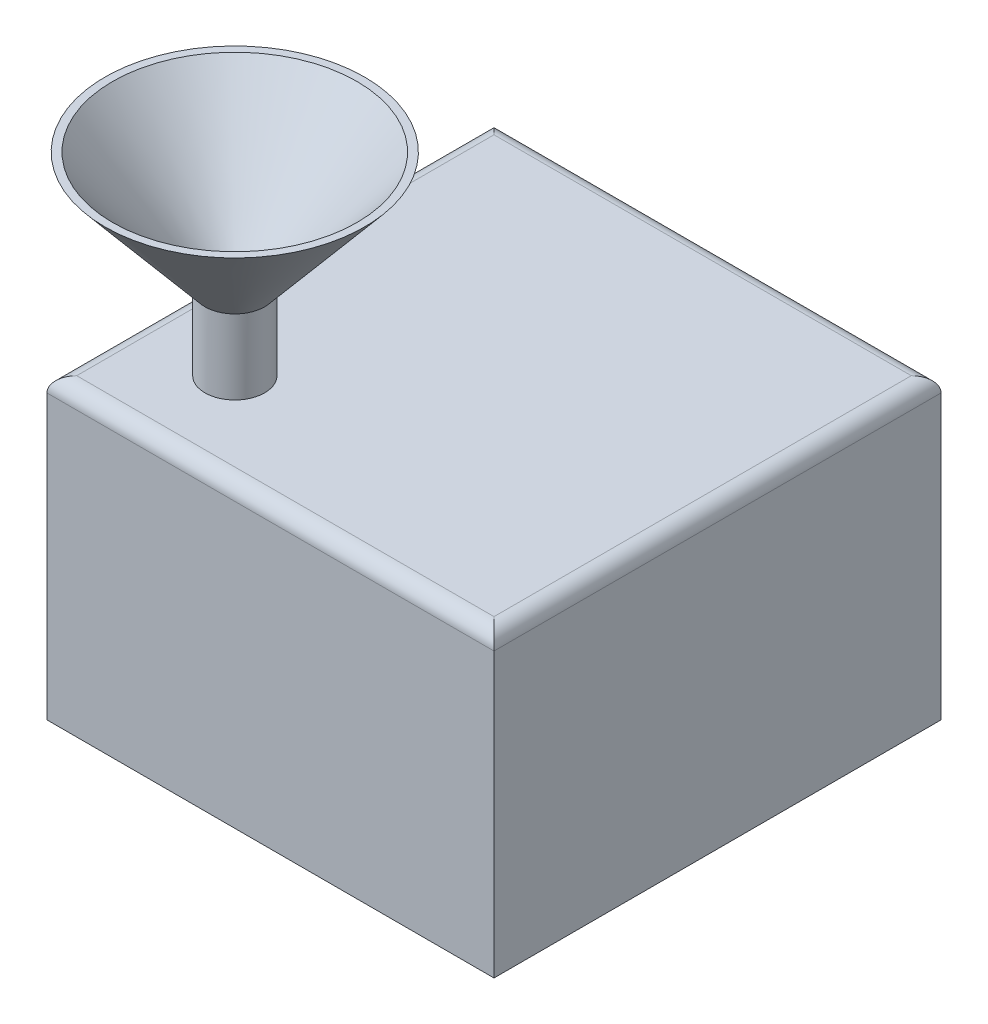
ISO-10303-21;
HEADER;
FILE_DESCRIPTION(('STEP AP214'),'2;1');
FILE_NAME('part.step','',(''),(''),'','','');
FILE_SCHEMA(('AUTOMOTIVE_DESIGN { 1 0 10303 214 1 1 1 1 }'));
ENDSEC;
DATA;
#1=APPLICATION_CONTEXT('core data for automotive mechanical design processes');
#2=APPLICATION_PROTOCOL_DEFINITION('international standard','automotive_design',2000,#1);
#3=PRODUCT_CONTEXT('',#1,'mechanical');
#4=PRODUCT('Part','Part','',(#3));
#5=PRODUCT_RELATED_PRODUCT_CATEGORY('part','',(#4));
#6=PRODUCT_DEFINITION_FORMATION('','',#4);
#7=PRODUCT_DEFINITION_CONTEXT('part definition',#1,'design');
#8=PRODUCT_DEFINITION('design','',#6,#7);
#9=PRODUCT_DEFINITION_SHAPE('','',#8);
#10=(LENGTH_UNIT() NAMED_UNIT(*) SI_UNIT(.MILLI.,.METRE.));
#11=(NAMED_UNIT(*) PLANE_ANGLE_UNIT() SI_UNIT($,.RADIAN.));
#12=(NAMED_UNIT(*) SI_UNIT($,.STERADIAN.) SOLID_ANGLE_UNIT());
#13=UNCERTAINTY_MEASURE_WITH_UNIT(LENGTH_MEASURE(1.E-05),#10,'distance_accuracy_value','');
#14=(GEOMETRIC_REPRESENTATION_CONTEXT(3) GLOBAL_UNCERTAINTY_ASSIGNED_CONTEXT((#13)) GLOBAL_UNIT_ASSIGNED_CONTEXT((#10,
#11,#12)) REPRESENTATION_CONTEXT('',''));
#15=CARTESIAN_POINT('',(0.,0.,0.));
#16=DIRECTION('',(0.,0.,1.));
#17=DIRECTION('',(1.,0.,0.));
#18=AXIS2_PLACEMENT_3D('',#15,#16,#17);
#19=CARTESIAN_POINT('',(0.,200.,0.));
#20=DIRECTION('',(0.,-1.,0.));
#21=DIRECTION('',(0.,0.,-1.));
#22=AXIS2_PLACEMENT_3D('',#19,#20,#21);
#23=PLANE('',#22);
#24=CARTESIAN_POINT('',(-86.966991411009,200.,86.966991411009));
#25=DIRECTION('',(0.,1.,0.));
#26=DIRECTION('',(0.,0.,1.));
#27=AXIS2_PLACEMENT_3D('',#24,#25,#26);
#28=CIRCLE('',#27,15.);
#29=CARTESIAN_POINT('',(-86.966991411009,200.,101.966991411009));
#30=VERTEX_POINT('',#29);
#31=EDGE_CURVE('E116',#30,#30,#28,.T.);
#32=ORIENTED_EDGE('',*,*,#31,.T.);
#33=EDGE_LOOP('',(#32));
#34=FACE_BOUND('',#33,.T.);
#35=ADVANCED_FACE('F36',(#34),#23,.F.);
#36=CARTESIAN_POINT('',(-86.966991411009,250.,86.966991411009));
#37=DIRECTION('',(0.,-1.,0.));
#38=DIRECTION('',(0.,0.,-1.));
#39=AXIS2_PLACEMENT_3D('',#36,#37,#38);
#40=CYLINDRICAL_SURFACE('',#39,15.);
#41=CARTESIAN_POINT('',(-86.966991411009,250.,86.966991411009));
#42=DIRECTION('',(0.,1.,0.));
#43=DIRECTION('',(0.,0.,1.));
#44=AXIS2_PLACEMENT_3D('',#41,#42,#43);
#45=CIRCLE('',#44,15.);
#46=CARTESIAN_POINT('',(-86.966991411009,250.,101.966991411009));
#47=VERTEX_POINT('',#46);
#48=EDGE_CURVE('E233',#47,#47,#45,.T.);
#49=ORIENTED_EDGE('',*,*,#48,.T.);
#50=EDGE_LOOP('',(#49));
#51=FACE_BOUND('',#50,.T.);
#52=ORIENTED_EDGE('',*,*,#31,.F.);
#53=EDGE_LOOP('',(#52));
#54=FACE_BOUND('',#53,.T.);
#55=ADVANCED_FACE('F174',(#51,#54),#40,.F.);
#56=CARTESIAN_POINT('',(-86.966991411009,250.,86.966991411009));
#57=DIRECTION('',(0.,1.,0.));
#58=DIRECTION('',(0.,0.,1.));
#59=AXIS2_PLACEMENT_3D('',#56,#57,#58);
#60=PLANE('',#59);
#61=CARTESIAN_POINT('',(-86.966991411009,250.,86.966991411009));
#62=DIRECTION('',(0.,1.,0.));
#63=DIRECTION('',(0.,0.,1.));
#64=AXIS2_PLACEMENT_3D('',#61,#62,#63);
#65=CIRCLE('',#64,14.8720295058174);
#66=CARTESIAN_POINT('',(-86.966991411009,250.,101.839020916826));
#67=VERTEX_POINT('',#66);
#68=EDGE_CURVE('E223',#67,#67,#65,.T.);
#69=ORIENTED_EDGE('',*,*,#68,.T.);
#70=EDGE_LOOP('',(#69));
#71=FACE_BOUND('',#70,.T.);
#72=ORIENTED_EDGE('',*,*,#48,.F.);
#73=EDGE_LOOP('',(#72));
#74=FACE_BOUND('',#73,.T.);
#75=ADVANCED_FACE('F180',(#71,#74),#60,.F.);
#76=CARTESIAN_POINT('',(-86.966991411009,330.,86.966991411009));
#77=DIRECTION('',(0.,1.,0.));
#78=DIRECTION('',(0.,0.,1.));
#79=AXIS2_PLACEMENT_3D('',#76,#77,#78);
#80=CONICAL_SURFACE('',#79,82.,0.698131700797733);
#81=ORIENTED_EDGE('',*,*,#68,.F.);
#82=EDGE_LOOP('',(#81));
#83=FACE_BOUND('',#82,.T.);
#84=CARTESIAN_POINT('',(-86.966991411009,330.,86.966991411009));
#85=DIRECTION('',(0.,1.,0.));
#86=DIRECTION('',(0.,0.,1.));
#87=AXIS2_PLACEMENT_3D('',#84,#85,#86);
#88=CIRCLE('',#87,82.);
#89=CARTESIAN_POINT('',(-86.966991411009,330.,168.966991411009));
#90=VERTEX_POINT('',#89);
#91=EDGE_CURVE('E226',#90,#90,#88,.T.);
#92=ORIENTED_EDGE('',*,*,#91,.T.);
#93=EDGE_LOOP('',(#92));
#94=FACE_BOUND('',#93,.T.);
#95=ADVANCED_FACE('F209',(#83,#94),#80,.F.);
#96=CARTESIAN_POINT('',(150.,200.,150.));
#97=DIRECTION('',(-1.,0.,0.));
#98=DIRECTION('',(0.,0.,1.));
#99=AXIS2_PLACEMENT_3D('',#96,#97,#98);
#100=PLANE('',#99);
#101=DIRECTION('',(0.,-1.,0.));
#102=VECTOR('',#101,1.);
#103=CARTESIAN_POINT('',(150.,200.,-150.));
#104=LINE('',#103,#102);
#105=CARTESIAN_POINT('',(150.,190.,-150.));
#106=VERTEX_POINT('',#105);
#107=CARTESIAN_POINT('',(150.,0.,-150.));
#108=VERTEX_POINT('',#107);
#109=EDGE_CURVE('E88',#106,#108,#104,.T.);
#110=ORIENTED_EDGE('',*,*,#109,.F.);
#111=DIRECTION('',(0.,0.,-1.));
#112=VECTOR('',#111,1.);
#113=CARTESIAN_POINT('',(150.,190.,150.));
#114=LINE('',#113,#112);
#115=CARTESIAN_POINT('',(150.,190.,150.));
#116=VERTEX_POINT('',#115);
#117=EDGE_CURVE('E44',#106,#116,#114,.F.);
#118=ORIENTED_EDGE('',*,*,#117,.T.);
#119=DIRECTION('',(0.,-1.,0.));
#120=VECTOR('',#119,1.);
#121=CARTESIAN_POINT('',(150.,200.,150.));
#122=LINE('',#121,#120);
#123=CARTESIAN_POINT('',(150.,0.,150.));
#124=VERTEX_POINT('',#123);
#125=EDGE_CURVE('E109',#116,#124,#122,.T.);
#126=ORIENTED_EDGE('',*,*,#125,.T.);
#127=DIRECTION('',(0.,0.,-1.));
#128=VECTOR('',#127,1.);
#129=CARTESIAN_POINT('',(150.,0.,150.));
#130=LINE('',#129,#128);
#131=EDGE_CURVE('E103',#124,#108,#130,.T.);
#132=ORIENTED_EDGE('',*,*,#131,.T.);
#133=EDGE_LOOP('',(#110,#118,#126,#132));
#134=FACE_BOUND('',#133,.T.);
#135=ADVANCED_FACE('F107',(#134),#100,.F.);
#136=CARTESIAN_POINT('',(-150.,200.,-150.));
#137=DIRECTION('',(0.,0.,1.));
#138=DIRECTION('',(1.,0.,0.));
#139=AXIS2_PLACEMENT_3D('',#136,#137,#138);
#140=PLANE('',#139);
#141=DIRECTION('',(0.,-1.,0.));
#142=VECTOR('',#141,1.);
#143=CARTESIAN_POINT('',(-150.,200.,-150.));
#144=LINE('',#143,#142);
#145=CARTESIAN_POINT('',(-150.,190.,-150.));
#146=VERTEX_POINT('',#145);
#147=CARTESIAN_POINT('',(-150.,0.,-150.));
#148=VERTEX_POINT('',#147);
#149=EDGE_CURVE('E97',#146,#148,#144,.T.);
#150=ORIENTED_EDGE('',*,*,#149,.F.);
#151=DIRECTION('',(-1.,0.,0.));
#152=VECTOR('',#151,1.);
#153=CARTESIAN_POINT('',(-150.,190.,-150.));
#154=LINE('',#153,#152);
#155=EDGE_CURVE('E51',#146,#106,#154,.F.);
#156=ORIENTED_EDGE('',*,*,#155,.T.);
#157=ORIENTED_EDGE('',*,*,#109,.T.);
#158=DIRECTION('',(-1.,0.,0.));
#159=VECTOR('',#158,1.);
#160=CARTESIAN_POINT('',(-150.,0.,-150.));
#161=LINE('',#160,#159);
#162=EDGE_CURVE('E91',#108,#148,#161,.T.);
#163=ORIENTED_EDGE('',*,*,#162,.T.);
#164=EDGE_LOOP('',(#150,#156,#157,#163));
#165=FACE_BOUND('',#164,.T.);
#166=ADVANCED_FACE('F90',(#165),#140,.F.);
#167=CARTESIAN_POINT('',(-150.,200.,150.));
#168=DIRECTION('',(1.,0.,0.));
#169=DIRECTION('',(0.,0.,-1.));
#170=AXIS2_PLACEMENT_3D('',#167,#168,#169);
#171=PLANE('',#170);
#172=DIRECTION('',(0.,-1.,0.));
#173=VECTOR('',#172,1.);
#174=CARTESIAN_POINT('',(-150.,200.,150.));
#175=LINE('',#174,#173);
#176=CARTESIAN_POINT('',(-150.,190.,150.));
#177=VERTEX_POINT('',#176);
#178=CARTESIAN_POINT('',(-150.,0.,150.));
#179=VERTEX_POINT('',#178);
#180=EDGE_CURVE('E123',#177,#179,#175,.T.);
#181=ORIENTED_EDGE('',*,*,#180,.F.);
#182=DIRECTION('',(0.,0.,1.));
#183=VECTOR('',#182,1.);
#184=CARTESIAN_POINT('',(-150.,190.,150.));
#185=LINE('',#184,#183);
#186=EDGE_CURVE('E59',#177,#146,#185,.F.);
#187=ORIENTED_EDGE('',*,*,#186,.T.);
#188=ORIENTED_EDGE('',*,*,#149,.T.);
#189=DIRECTION('',(0.,0.,1.));
#190=VECTOR('',#189,1.);
#191=CARTESIAN_POINT('',(-150.,0.,150.));
#192=LINE('',#191,#190);
#193=EDGE_CURVE('E105',#148,#179,#192,.T.);
#194=ORIENTED_EDGE('',*,*,#193,.T.);
#195=EDGE_LOOP('',(#181,#187,#188,#194));
#196=FACE_BOUND('',#195,.T.);
#197=ADVANCED_FACE('F164',(#196),#171,.F.);
#198=CARTESIAN_POINT('',(-150.,200.,150.));
#199=DIRECTION('',(0.,0.,-1.));
#200=DIRECTION('',(-1.,0.,0.));
#201=AXIS2_PLACEMENT_3D('',#198,#199,#200);
#202=PLANE('',#201);
#203=ORIENTED_EDGE('',*,*,#125,.F.);
#204=DIRECTION('',(1.,0.,0.));
#205=VECTOR('',#204,1.);
#206=CARTESIAN_POINT('',(-150.,190.,150.));
#207=LINE('',#206,#205);
#208=EDGE_CURVE('E134',#116,#177,#207,.F.);
#209=ORIENTED_EDGE('',*,*,#208,.T.);
#210=ORIENTED_EDGE('',*,*,#180,.T.);
#211=DIRECTION('',(1.,0.,0.));
#212=VECTOR('',#211,1.);
#213=CARTESIAN_POINT('',(-150.,0.,150.));
#214=LINE('',#213,#212);
#215=EDGE_CURVE('E120',#179,#124,#214,.T.);
#216=ORIENTED_EDGE('',*,*,#215,.T.);
#217=EDGE_LOOP('',(#203,#209,#210,#216));
#218=FACE_BOUND('',#217,.T.);
#219=ADVANCED_FACE('F163',(#218),#202,.F.);
#220=CARTESIAN_POINT('',(-86.966991411009,200.,86.966991411009));
#221=DIRECTION('',(0.,-1.,0.));
#222=DIRECTION('',(0.,0.,-1.));
#223=AXIS2_PLACEMENT_3D('',#220,#221,#222);
#224=CIRCLE('',#223,20.);
#225=CARTESIAN_POINT('',(-86.966991411009,200.,66.9669914110089));
#226=VERTEX_POINT('',#225);
#227=EDGE_CURVE('E11',#226,#226,#224,.F.);
#228=ORIENTED_EDGE('',*,*,#227,.F.);
#229=EDGE_LOOP('',(#228));
#230=FACE_BOUND('',#229,.T.);
#231=DIRECTION('',(0.,0.,1.));
#232=VECTOR('',#231,1.);
#233=CARTESIAN_POINT('',(-140.,200.,0.));
#234=LINE('',#233,#232);
#235=CARTESIAN_POINT('',(-140.,200.,-140.));
#236=VERTEX_POINT('',#235);
#237=CARTESIAN_POINT('',(-140.,200.,140.));
#238=VERTEX_POINT('',#237);
#239=EDGE_CURVE('E129',#236,#238,#234,.T.);
#240=ORIENTED_EDGE('',*,*,#239,.T.);
#241=DIRECTION('',(1.,0.,0.));
#242=VECTOR('',#241,1.);
#243=CARTESIAN_POINT('',(0.,200.,140.));
#244=LINE('',#243,#242);
#245=CARTESIAN_POINT('',(140.,200.,140.));
#246=VERTEX_POINT('',#245);
#247=EDGE_CURVE('E131',#238,#246,#244,.T.);
#248=ORIENTED_EDGE('',*,*,#247,.T.);
#249=DIRECTION('',(0.,0.,-1.));
#250=VECTOR('',#249,1.);
#251=CARTESIAN_POINT('',(140.,200.,0.));
#252=LINE('',#251,#250);
#253=CARTESIAN_POINT('',(140.,200.,-140.));
#254=VERTEX_POINT('',#253);
#255=EDGE_CURVE('E96',#246,#254,#252,.T.);
#256=ORIENTED_EDGE('',*,*,#255,.T.);
#257=DIRECTION('',(-1.,0.,0.));
#258=VECTOR('',#257,1.);
#259=CARTESIAN_POINT('',(0.,200.,-140.));
#260=LINE('',#259,#258);
#261=EDGE_CURVE('E127',#254,#236,#260,.T.);
#262=ORIENTED_EDGE('',*,*,#261,.T.);
#263=EDGE_LOOP('',(#240,#248,#256,#262));
#264=FACE_BOUND('',#263,.T.);
#265=ADVANCED_FACE('F156',(#230,#264),#23,.F.);
#266=CARTESIAN_POINT('',(0.,0.,0.));
#267=DIRECTION('',(0.,-1.,0.));
#268=DIRECTION('',(0.,0.,-1.));
#269=AXIS2_PLACEMENT_3D('',#266,#267,#268);
#270=PLANE('',#269);
#271=ORIENTED_EDGE('',*,*,#131,.F.);
#272=ORIENTED_EDGE('',*,*,#215,.F.);
#273=ORIENTED_EDGE('',*,*,#193,.F.);
#274=ORIENTED_EDGE('',*,*,#162,.F.);
#275=EDGE_LOOP('',(#271,#272,#273,#274));
#276=FACE_BOUND('',#275,.T.);
#277=ADVANCED_FACE('F101',(#276),#270,.T.);
#278=CARTESIAN_POINT('',(0.,190.,-140.));
#279=DIRECTION('',(-1.,0.,0.));
#280=DIRECTION('',(0.,0.,1.));
#281=AXIS2_PLACEMENT_3D('',#278,#279,#280);
#282=CYLINDRICAL_SURFACE('',#281,10.);
#283=CARTESIAN_POINT('',(140.,190.,-140.));
#284=DIRECTION('',(-0.707106781186547,0.,-0.707106781186547));
#285=DIRECTION('',(0.707106781186547,0.,-0.707106781186547));
#286=AXIS2_PLACEMENT_3D('',#283,#284,#285);
#287=ELLIPSE('',#286,14.1421356237309,10.);
#288=EDGE_CURVE('E114',#106,#254,#287,.F.);
#289=ORIENTED_EDGE('',*,*,#288,.F.);
#290=ORIENTED_EDGE('',*,*,#155,.F.);
#291=CARTESIAN_POINT('',(-140.,190.,-140.));
#292=DIRECTION('',(-0.707106781186547,0.,0.707106781186547));
#293=DIRECTION('',(-0.707106781186547,0.,-0.707106781186547));
#294=AXIS2_PLACEMENT_3D('',#291,#292,#293);
#295=ELLIPSE('',#294,14.1421356237309,10.);
#296=EDGE_CURVE('E111',#236,#146,#295,.T.);
#297=ORIENTED_EDGE('',*,*,#296,.F.);
#298=ORIENTED_EDGE('',*,*,#261,.F.);
#299=EDGE_LOOP('',(#289,#290,#297,#298));
#300=FACE_BOUND('',#299,.T.);
#301=ADVANCED_FACE('F38',(#300),#282,.T.);
#302=CARTESIAN_POINT('',(-140.,190.,0.));
#303=DIRECTION('',(0.,0.,1.));
#304=DIRECTION('',(1.,0.,0.));
#305=AXIS2_PLACEMENT_3D('',#302,#303,#304);
#306=CYLINDRICAL_SURFACE('',#305,10.);
#307=ORIENTED_EDGE('',*,*,#296,.T.);
#308=ORIENTED_EDGE('',*,*,#186,.F.);
#309=CARTESIAN_POINT('',(-140.,190.,140.));
#310=DIRECTION('',(0.707106781186547,0.,0.707106781186547));
#311=DIRECTION('',(-0.707106781186547,0.,0.707106781186547));
#312=AXIS2_PLACEMENT_3D('',#309,#310,#311);
#313=ELLIPSE('',#312,14.1421356237309,10.);
#314=EDGE_CURVE('E142',#238,#177,#313,.T.);
#315=ORIENTED_EDGE('',*,*,#314,.F.);
#316=ORIENTED_EDGE('',*,*,#239,.F.);
#317=EDGE_LOOP('',(#307,#308,#315,#316));
#318=FACE_BOUND('',#317,.T.);
#319=ADVANCED_FACE('F247',(#318),#306,.T.);
#320=CARTESIAN_POINT('',(140.,190.,0.));
#321=DIRECTION('',(0.,0.,-1.));
#322=DIRECTION('',(-1.,0.,0.));
#323=AXIS2_PLACEMENT_3D('',#320,#321,#322);
#324=CYLINDRICAL_SURFACE('',#323,10.);
#325=ORIENTED_EDGE('',*,*,#288,.T.);
#326=ORIENTED_EDGE('',*,*,#255,.F.);
#327=CARTESIAN_POINT('',(140.,190.,140.));
#328=DIRECTION('',(0.707106781186547,0.,-0.707106781186547));
#329=DIRECTION('',(-0.707106781186547,0.,-0.707106781186547));
#330=AXIS2_PLACEMENT_3D('',#327,#328,#329);
#331=ELLIPSE('',#330,14.1421356237309,10.);
#332=EDGE_CURVE('E140',#116,#246,#331,.F.);
#333=ORIENTED_EDGE('',*,*,#332,.F.);
#334=ORIENTED_EDGE('',*,*,#117,.F.);
#335=EDGE_LOOP('',(#325,#326,#333,#334));
#336=FACE_BOUND('',#335,.T.);
#337=ADVANCED_FACE('F149',(#336),#324,.T.);
#338=CARTESIAN_POINT('',(0.,190.,140.));
#339=DIRECTION('',(1.,0.,0.));
#340=DIRECTION('',(0.,0.,-1.));
#341=AXIS2_PLACEMENT_3D('',#338,#339,#340);
#342=CYLINDRICAL_SURFACE('',#341,10.);
#343=ORIENTED_EDGE('',*,*,#314,.T.);
#344=ORIENTED_EDGE('',*,*,#208,.F.);
#345=ORIENTED_EDGE('',*,*,#332,.T.);
#346=ORIENTED_EDGE('',*,*,#247,.F.);
#347=EDGE_LOOP('',(#343,#344,#345,#346));
#348=FACE_BOUND('',#347,.T.);
#349=ADVANCED_FACE('F160',(#348),#342,.T.);
#350=CARTESIAN_POINT('',(-86.966991411009,250.,86.966991411009));
#351=DIRECTION('',(0.,-1.,0.));
#352=DIRECTION('',(0.,0.,-1.));
#353=AXIS2_PLACEMENT_3D('',#350,#351,#352);
#354=CYLINDRICAL_SURFACE('',#353,20.);
#355=CARTESIAN_POINT('',(-86.966991411009,250.,86.966991411009));
#356=DIRECTION('',(0.,1.,0.));
#357=DIRECTION('',(0.,0.,1.));
#358=AXIS2_PLACEMENT_3D('',#355,#356,#357);
#359=CIRCLE('',#358,20.);
#360=CARTESIAN_POINT('',(-86.966991411009,250.,106.966991411009));
#361=VERTEX_POINT('',#360);
#362=EDGE_CURVE('E143',#361,#361,#359,.T.);
#363=ORIENTED_EDGE('',*,*,#362,.F.);
#364=EDGE_LOOP('',(#363));
#365=FACE_BOUND('',#364,.T.);
#366=ORIENTED_EDGE('',*,*,#227,.T.);
#367=EDGE_LOOP('',(#366));
#368=FACE_BOUND('',#367,.T.);
#369=ADVANCED_FACE('F192',(#365,#368),#354,.T.);
#370=CARTESIAN_POINT('',(-86.966991411009,250.,86.966991411009));
#371=DIRECTION('',(0.,1.,0.));
#372=DIRECTION('',(0.,0.,1.));
#373=AXIS2_PLACEMENT_3D('',#370,#371,#372);
#374=CONICAL_SURFACE('',#373,20.,0.698131700797733);
#375=CARTESIAN_POINT('',(-86.966991411009,330.,86.966991411009));
#376=DIRECTION('',(0.,1.,0.));
#377=DIRECTION('',(0.,0.,1.));
#378=AXIS2_PLACEMENT_3D('',#375,#376,#377);
#379=CIRCLE('',#378,87.1279704941826);
#380=CARTESIAN_POINT('',(-86.966991411009,330.,174.094961905192));
#381=VERTEX_POINT('',#380);
#382=EDGE_CURVE('E228',#381,#381,#379,.T.);
#383=ORIENTED_EDGE('',*,*,#382,.F.);
#384=EDGE_LOOP('',(#383));
#385=FACE_BOUND('',#384,.T.);
#386=ORIENTED_EDGE('',*,*,#362,.T.);
#387=EDGE_LOOP('',(#386));
#388=FACE_BOUND('',#387,.T.);
#389=ADVANCED_FACE('F194',(#385,#388),#374,.T.);
#390=CARTESIAN_POINT('',(-86.966991411009,330.,86.966991411009));
#391=DIRECTION('',(0.,1.,0.));
#392=DIRECTION('',(0.,0.,1.));
#393=AXIS2_PLACEMENT_3D('',#390,#391,#392);
#394=PLANE('',#393);
#395=ORIENTED_EDGE('',*,*,#91,.F.);
#396=EDGE_LOOP('',(#395));
#397=FACE_BOUND('',#396,.T.);
#398=ORIENTED_EDGE('',*,*,#382,.T.);
#399=EDGE_LOOP('',(#398));
#400=FACE_BOUND('',#399,.T.);
#401=ADVANCED_FACE('F201',(#397,#400),#394,.T.);
#402=CLOSED_SHELL('',(#35,#55,#75,#95,#135,#166,#197,#219,#265,#277,#301,#319,#337,#349,#369,
#389,#401));
#403=MANIFOLD_SOLID_BREP('B2',#402);
#404=ADVANCED_BREP_SHAPE_REPRESENTATION('',(#18,#403),#14);
#405=SHAPE_DEFINITION_REPRESENTATION(#9,#404);
ENDSEC;
END-ISO-10303-21;
